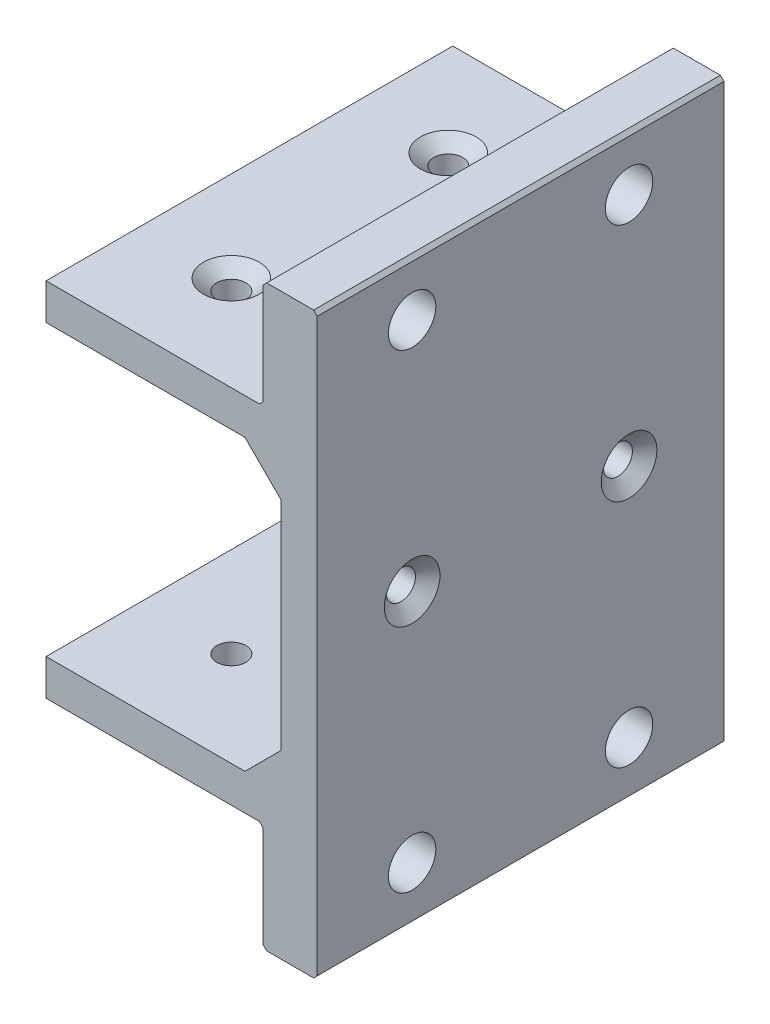
ISO-10303-21;
HEADER;
FILE_DESCRIPTION(('STEP AP214'),'2;1');
FILE_NAME('part.step','',(''),(''),'','','');
FILE_SCHEMA(('AUTOMOTIVE_DESIGN { 1 0 10303 214 1 1 1 1 }'));
ENDSEC;
DATA;
#1=APPLICATION_CONTEXT('core data for automotive mechanical design processes');
#2=APPLICATION_PROTOCOL_DEFINITION('international standard','automotive_design',2000,#1);
#3=PRODUCT_CONTEXT('',#1,'mechanical');
#4=PRODUCT('Part','Part','',(#3));
#5=PRODUCT_RELATED_PRODUCT_CATEGORY('part','',(#4));
#6=PRODUCT_DEFINITION_FORMATION('','',#4);
#7=PRODUCT_DEFINITION_CONTEXT('part definition',#1,'design');
#8=PRODUCT_DEFINITION('design','',#6,#7);
#9=PRODUCT_DEFINITION_SHAPE('','',#8);
#10=(LENGTH_UNIT() NAMED_UNIT(*) SI_UNIT(.MILLI.,.METRE.));
#11=(NAMED_UNIT(*) PLANE_ANGLE_UNIT() SI_UNIT($,.RADIAN.));
#12=(NAMED_UNIT(*) SI_UNIT($,.STERADIAN.) SOLID_ANGLE_UNIT());
#13=UNCERTAINTY_MEASURE_WITH_UNIT(LENGTH_MEASURE(1.E-05),#10,'distance_accuracy_value','');
#14=(GEOMETRIC_REPRESENTATION_CONTEXT(3) GLOBAL_UNCERTAINTY_ASSIGNED_CONTEXT((#13)) GLOBAL_UNIT_ASSIGNED_CONTEXT((#10,
#11,#12)) REPRESENTATION_CONTEXT('',''));
#15=CARTESIAN_POINT('',(0.,0.,0.));
#16=DIRECTION('',(0.,0.,1.));
#17=DIRECTION('',(1.,0.,0.));
#18=AXIS2_PLACEMENT_3D('',#15,#16,#17);
#19=CARTESIAN_POINT('',(-15.875,-25.4,35.7124));
#20=DIRECTION('',(0.,1.,0.));
#21=DIRECTION('',(1.,0.,0.));
#22=AXIS2_PLACEMENT_3D('',#19,#20,#21);
#23=PLANE('',#22);
#24=DIRECTION('',(-1.,0.,0.));
#25=VECTOR('',#24,1.);
#26=CARTESIAN_POINT('',(19.05,-25.4,-35.7124));
#27=LINE('',#26,#25);
#28=CARTESIAN_POINT('',(19.05,-25.4,-35.7124));
#29=VERTEX_POINT('',#28);
#30=CARTESIAN_POINT('',(-15.875,-25.4,-35.7124));
#31=VERTEX_POINT('',#30);
#32=EDGE_CURVE('E155',#29,#31,#27,.T.);
#33=ORIENTED_EDGE('',*,*,#32,.T.);
#34=DIRECTION('',(0.,0.,1.));
#35=VECTOR('',#34,1.);
#36=CARTESIAN_POINT('',(-15.875,-25.4,-35.7124));
#37=LINE('',#36,#35);
#38=CARTESIAN_POINT('',(-15.875,-25.4,35.7124));
#39=VERTEX_POINT('',#38);
#40=EDGE_CURVE('E170',#39,#31,#37,.F.);
#41=ORIENTED_EDGE('',*,*,#40,.F.);
#42=DIRECTION('',(1.,0.,0.));
#43=VECTOR('',#42,1.);
#44=CARTESIAN_POINT('',(-15.875,-25.4,35.7124));
#45=LINE('',#44,#43);
#46=CARTESIAN_POINT('',(19.05,-25.4,35.7124));
#47=VERTEX_POINT('',#46);
#48=EDGE_CURVE('E177',#47,#39,#45,.F.);
#49=ORIENTED_EDGE('',*,*,#48,.F.);
#50=DIRECTION('',(0.,0.,-1.));
#51=VECTOR('',#50,1.);
#52=CARTESIAN_POINT('',(19.05,-25.4,35.7124));
#53=LINE('',#52,#51);
#54=EDGE_CURVE('E172',#47,#29,#53,.T.);
#55=ORIENTED_EDGE('',*,*,#54,.T.);
#56=EDGE_LOOP('',(#33,#41,#49,#55));
#57=FACE_BOUND('',#56,.T.);
#58=CARTESIAN_POINT('',(0.,-25.4,19.05));
#59=DIRECTION('',(0.,-1.,0.));
#60=DIRECTION('',(0.,0.,1.));
#61=AXIS2_PLACEMENT_3D('',#58,#59,#60);
#62=CIRCLE('',#61,2.5527);
#63=CARTESIAN_POINT('',(0.,-25.4,21.6027));
#64=VERTEX_POINT('',#63);
#65=EDGE_CURVE('E188',#64,#64,#62,.F.);
#66=ORIENTED_EDGE('',*,*,#65,.F.);
#67=EDGE_LOOP('',(#66));
#68=FACE_BOUND('',#67,.T.);
#69=CARTESIAN_POINT('',(0.,-25.4,-19.05));
#70=DIRECTION('',(0.,-1.,0.));
#71=DIRECTION('',(0.,0.,1.));
#72=AXIS2_PLACEMENT_3D('',#69,#70,#71);
#73=CIRCLE('',#72,2.5527);
#74=CARTESIAN_POINT('',(0.,-25.4,-16.4973));
#75=VERTEX_POINT('',#74);
#76=EDGE_CURVE('E163',#75,#75,#73,.F.);
#77=ORIENTED_EDGE('',*,*,#76,.F.);
#78=EDGE_LOOP('',(#77));
#79=FACE_BOUND('',#78,.T.);
#80=ADVANCED_FACE('F17',(#57,#68,#79),#23,.T.);
#81=CARTESIAN_POINT('',(-15.875,-31.75,35.7124));
#82=DIRECTION('',(-1.,0.,0.));
#83=DIRECTION('',(0.,1.,0.));
#84=AXIS2_PLACEMENT_3D('',#81,#82,#83);
#85=PLANE('',#84);
#86=DIRECTION('',(0.,-1.,0.));
#87=VECTOR('',#86,1.);
#88=CARTESIAN_POINT('',(-15.875,-25.4,-35.7124));
#89=LINE('',#88,#87);
#90=CARTESIAN_POINT('',(-15.875,-31.75,-35.7124));
#91=VERTEX_POINT('',#90);
#92=EDGE_CURVE('E152',#31,#91,#89,.T.);
#93=ORIENTED_EDGE('',*,*,#92,.T.);
#94=DIRECTION('',(0.,0.,1.));
#95=VECTOR('',#94,1.);
#96=CARTESIAN_POINT('',(-15.875,-31.75,-35.7124));
#97=LINE('',#96,#95);
#98=CARTESIAN_POINT('',(-15.875,-31.75,35.7124));
#99=VERTEX_POINT('',#98);
#100=EDGE_CURVE('E162',#99,#91,#97,.F.);
#101=ORIENTED_EDGE('',*,*,#100,.F.);
#102=DIRECTION('',(0.,1.,0.));
#103=VECTOR('',#102,1.);
#104=CARTESIAN_POINT('',(-15.875,-31.75,35.7124));
#105=LINE('',#104,#103);
#106=EDGE_CURVE('E176',#39,#99,#105,.F.);
#107=ORIENTED_EDGE('',*,*,#106,.F.);
#108=ORIENTED_EDGE('',*,*,#40,.T.);
#109=EDGE_LOOP('',(#93,#101,#107,#108));
#110=FACE_BOUND('',#109,.T.);
#111=ADVANCED_FACE('F175',(#110),#85,.T.);
#112=CARTESIAN_POINT('',(-15.875,-31.75,-35.7124));
#113=DIRECTION('',(0.,-1.,0.));
#114=DIRECTION('',(1.,0.,0.));
#115=AXIS2_PLACEMENT_3D('',#112,#113,#114);
#116=PLANE('',#115);
#117=DIRECTION('',(1.,0.,0.));
#118=VECTOR('',#117,1.);
#119=CARTESIAN_POINT('',(-15.875,-31.75,-35.7124));
#120=LINE('',#119,#118);
#121=CARTESIAN_POINT('',(21.59,-31.75,-35.7124));
#122=VERTEX_POINT('',#121);
#123=EDGE_CURVE('E157',#91,#122,#120,.T.);
#124=ORIENTED_EDGE('',*,*,#123,.T.);
#125=DIRECTION('',(0.,0.,1.));
#126=VECTOR('',#125,1.);
#127=CARTESIAN_POINT('',(21.59,-31.75,-35.7124));
#128=LINE('',#127,#126);
#129=CARTESIAN_POINT('',(21.59,-31.75,35.7124));
#130=VERTEX_POINT('',#129);
#131=EDGE_CURVE('E204',#130,#122,#128,.F.);
#132=ORIENTED_EDGE('',*,*,#131,.F.);
#133=DIRECTION('',(-1.,0.,0.));
#134=VECTOR('',#133,1.);
#135=CARTESIAN_POINT('',(21.59,-31.75,35.7124));
#136=LINE('',#135,#134);
#137=EDGE_CURVE('E209',#99,#130,#136,.F.);
#138=ORIENTED_EDGE('',*,*,#137,.F.);
#139=ORIENTED_EDGE('',*,*,#100,.T.);
#140=EDGE_LOOP('',(#124,#132,#138,#139));
#141=FACE_BOUND('',#140,.T.);
#142=CARTESIAN_POINT('',(0.,-31.75,19.05));
#143=DIRECTION('',(0.,1.,0.));
#144=DIRECTION('',(0.,0.,-1.));
#145=AXIS2_PLACEMENT_3D('',#142,#143,#144);
#146=CIRCLE('',#145,4.8895);
#147=CARTESIAN_POINT('',(0.,-31.75,14.1605));
#148=VERTEX_POINT('',#147);
#149=EDGE_CURVE('E213',#148,#148,#146,.T.);
#150=ORIENTED_EDGE('',*,*,#149,.T.);
#151=EDGE_LOOP('',(#150));
#152=FACE_BOUND('',#151,.T.);
#153=CARTESIAN_POINT('',(0.,-31.75,-19.05));
#154=DIRECTION('',(0.,1.,0.));
#155=DIRECTION('',(0.,0.,-1.));
#156=AXIS2_PLACEMENT_3D('',#153,#154,#155);
#157=CIRCLE('',#156,4.8895);
#158=CARTESIAN_POINT('',(0.,-31.75,-23.9395));
#159=VERTEX_POINT('',#158);
#160=EDGE_CURVE('E218',#159,#159,#157,.T.);
#161=ORIENTED_EDGE('',*,*,#160,.T.);
#162=EDGE_LOOP('',(#161));
#163=FACE_BOUND('',#162,.T.);
#164=ADVANCED_FACE('F533',(#141,#152,#163),#116,.T.);
#165=CARTESIAN_POINT('',(22.225,-32.385,-35.7124));
#166=DIRECTION('',(-0.707106781186546,-0.70710678118655,0.));
#167=DIRECTION('',(0.,0.,1.));
#168=AXIS2_PLACEMENT_3D('',#165,#166,#167);
#169=PLANE('',#168);
#170=DIRECTION('',(0.707106781186546,-0.70710678118655,0.));
#171=VECTOR('',#170,1.);
#172=CARTESIAN_POINT('',(21.59,-31.75,-35.7124));
#173=LINE('',#172,#171);
#174=CARTESIAN_POINT('',(22.225,-32.385,-35.7124));
#175=VERTEX_POINT('',#174);
#176=EDGE_CURVE('E221',#122,#175,#173,.T.);
#177=ORIENTED_EDGE('',*,*,#176,.T.);
#178=DIRECTION('',(0.,0.,1.));
#179=VECTOR('',#178,1.);
#180=CARTESIAN_POINT('',(22.225,-32.385,-35.7124));
#181=LINE('',#180,#179);
#182=CARTESIAN_POINT('',(22.225,-32.385,35.7124));
#183=VERTEX_POINT('',#182);
#184=EDGE_CURVE('E224',#183,#175,#181,.F.);
#185=ORIENTED_EDGE('',*,*,#184,.F.);
#186=DIRECTION('',(-0.707106781186548,0.707106781186548,0.));
#187=VECTOR('',#186,1.);
#188=CARTESIAN_POINT('',(22.225,-32.385,35.7124));
#189=LINE('',#188,#187);
#190=EDGE_CURVE('E229',#130,#183,#189,.F.);
#191=ORIENTED_EDGE('',*,*,#190,.F.);
#192=ORIENTED_EDGE('',*,*,#131,.T.);
#193=EDGE_LOOP('',(#177,#185,#191,#192));
#194=FACE_BOUND('',#193,.T.);
#195=ADVANCED_FACE('F538',(#194),#169,.T.);
#196=CARTESIAN_POINT('',(22.225,-50.165,35.7124));
#197=DIRECTION('',(-1.,0.,0.));
#198=DIRECTION('',(0.,1.,0.));
#199=AXIS2_PLACEMENT_3D('',#196,#197,#198);
#200=PLANE('',#199);
#201=DIRECTION('',(0.,-1.,0.));
#202=VECTOR('',#201,1.);
#203=CARTESIAN_POINT('',(22.225,-32.385,-35.7124));
#204=LINE('',#203,#202);
#205=CARTESIAN_POINT('',(22.225,-50.165,-35.7124));
#206=VERTEX_POINT('',#205);
#207=EDGE_CURVE('E233',#175,#206,#204,.T.);
#208=ORIENTED_EDGE('',*,*,#207,.T.);
#209=DIRECTION('',(0.,0.,1.));
#210=VECTOR('',#209,1.);
#211=CARTESIAN_POINT('',(22.225,-50.165,-35.7124));
#212=LINE('',#211,#210);
#213=CARTESIAN_POINT('',(22.225,-50.165,35.7124));
#214=VERTEX_POINT('',#213);
#215=EDGE_CURVE('E238',#214,#206,#212,.F.);
#216=ORIENTED_EDGE('',*,*,#215,.F.);
#217=DIRECTION('',(0.,1.,0.));
#218=VECTOR('',#217,1.);
#219=CARTESIAN_POINT('',(22.225,-50.165,35.7124));
#220=LINE('',#219,#218);
#221=EDGE_CURVE('E243',#183,#214,#220,.F.);
#222=ORIENTED_EDGE('',*,*,#221,.F.);
#223=ORIENTED_EDGE('',*,*,#184,.T.);
#224=EDGE_LOOP('',(#208,#216,#222,#223));
#225=FACE_BOUND('',#224,.T.);
#226=CARTESIAN_POINT('',(22.225,-41.275,-19.05));
#227=DIRECTION('',(1.,0.,0.));
#228=DIRECTION('',(0.,-1.42053837271799E-07,0.99999999999999));
#229=AXIS2_PLACEMENT_3D('',#226,#227,#228);
#230=CIRCLE('',#229,4.1656);
#231=CARTESIAN_POINT('',(22.225,-41.2750005917395,-14.8844));
#232=VERTEX_POINT('',#231);
#233=EDGE_CURVE('E247',#232,#232,#230,.T.);
#234=ORIENTED_EDGE('',*,*,#233,.T.);
#235=EDGE_LOOP('',(#234));
#236=FACE_BOUND('',#235,.T.);
#237=CARTESIAN_POINT('',(22.225,-41.275,19.05));
#238=DIRECTION('',(1.,0.,0.));
#239=DIRECTION('',(0.,-1.42053931087456E-07,0.99999999999999));
#240=AXIS2_PLACEMENT_3D('',#237,#238,#239);
#241=CIRCLE('',#240,4.1656);
#242=CARTESIAN_POINT('',(22.225,-41.2750005917399,23.2156));
#243=VERTEX_POINT('',#242);
#244=EDGE_CURVE('E252',#243,#243,#241,.T.);
#245=ORIENTED_EDGE('',*,*,#244,.T.);
#246=EDGE_LOOP('',(#245));
#247=FACE_BOUND('',#246,.T.);
#248=ADVANCED_FACE('F542',(#225,#236,#247),#200,.T.);
#249=CARTESIAN_POINT('',(22.86,-50.8,-35.7124));
#250=DIRECTION('',(-0.707106781186546,-0.70710678118655,0.));
#251=DIRECTION('',(0.,0.,1.));
#252=AXIS2_PLACEMENT_3D('',#249,#250,#251);
#253=PLANE('',#252);
#254=DIRECTION('',(0.707106781186552,-0.707106781186544,0.));
#255=VECTOR('',#254,1.);
#256=CARTESIAN_POINT('',(22.225,-50.165,-35.7124));
#257=LINE('',#256,#255);
#258=CARTESIAN_POINT('',(22.86,-50.8,-35.7124));
#259=VERTEX_POINT('',#258);
#260=EDGE_CURVE('E255',#206,#259,#257,.T.);
#261=ORIENTED_EDGE('',*,*,#260,.T.);
#262=DIRECTION('',(0.,0.,1.));
#263=VECTOR('',#262,1.);
#264=CARTESIAN_POINT('',(22.86,-50.8,-35.7124));
#265=LINE('',#264,#263);
#266=CARTESIAN_POINT('',(22.86,-50.8,35.7124));
#267=VERTEX_POINT('',#266);
#268=EDGE_CURVE('E258',#267,#259,#265,.F.);
#269=ORIENTED_EDGE('',*,*,#268,.F.);
#270=DIRECTION('',(-0.707106781186548,0.707106781186548,0.));
#271=VECTOR('',#270,1.);
#272=CARTESIAN_POINT('',(22.86,-50.8,35.7124));
#273=LINE('',#272,#271);
#274=EDGE_CURVE('E263',#214,#267,#273,.F.);
#275=ORIENTED_EDGE('',*,*,#274,.F.);
#276=ORIENTED_EDGE('',*,*,#215,.T.);
#277=EDGE_LOOP('',(#261,#269,#275,#276));
#278=FACE_BOUND('',#277,.T.);
#279=ADVANCED_FACE('F546',(#278),#253,.T.);
#280=CARTESIAN_POINT('',(22.86,-50.8,-35.7124));
#281=DIRECTION('',(0.,-1.,0.));
#282=DIRECTION('',(1.,0.,0.));
#283=AXIS2_PLACEMENT_3D('',#280,#281,#282);
#284=PLANE('',#283);
#285=DIRECTION('',(1.,0.,0.));
#286=VECTOR('',#285,1.);
#287=CARTESIAN_POINT('',(22.86,-50.8,-35.7124));
#288=LINE('',#287,#286);
#289=CARTESIAN_POINT('',(31.115,-50.8,-35.7124));
#290=VERTEX_POINT('',#289);
#291=EDGE_CURVE('E267',#259,#290,#288,.T.);
#292=ORIENTED_EDGE('',*,*,#291,.T.);
#293=DIRECTION('',(0.,0.,1.));
#294=VECTOR('',#293,1.);
#295=CARTESIAN_POINT('',(31.115,-50.8,-35.7124));
#296=LINE('',#295,#294);
#297=CARTESIAN_POINT('',(31.115,-50.8,35.7124));
#298=VERTEX_POINT('',#297);
#299=EDGE_CURVE('E272',#298,#290,#296,.F.);
#300=ORIENTED_EDGE('',*,*,#299,.F.);
#301=DIRECTION('',(-1.,0.,0.));
#302=VECTOR('',#301,1.);
#303=CARTESIAN_POINT('',(31.115,-50.8,35.7124));
#304=LINE('',#303,#302);
#305=EDGE_CURVE('E277',#267,#298,#304,.F.);
#306=ORIENTED_EDGE('',*,*,#305,.F.);
#307=ORIENTED_EDGE('',*,*,#268,.T.);
#308=EDGE_LOOP('',(#292,#300,#306,#307));
#309=FACE_BOUND('',#308,.T.);
#310=ADVANCED_FACE('F550',(#309),#284,.T.);
#311=CARTESIAN_POINT('',(31.75,-50.165,-35.7124));
#312=DIRECTION('',(0.707106781186546,-0.70710678118655,0.));
#313=DIRECTION('',(0.,0.,1.));
#314=AXIS2_PLACEMENT_3D('',#311,#312,#313);
#315=PLANE('',#314);
#316=DIRECTION('',(0.70710678118655,0.707106781186546,0.));
#317=VECTOR('',#316,1.);
#318=CARTESIAN_POINT('',(31.115,-50.8,-35.7124));
#319=LINE('',#318,#317);
#320=CARTESIAN_POINT('',(31.75,-50.165,-35.7124));
#321=VERTEX_POINT('',#320);
#322=EDGE_CURVE('E281',#290,#321,#319,.T.);
#323=ORIENTED_EDGE('',*,*,#322,.T.);
#324=DIRECTION('',(0.,0.,1.));
#325=VECTOR('',#324,1.);
#326=CARTESIAN_POINT('',(31.75,-50.165,-35.7124));
#327=LINE('',#326,#325);
#328=CARTESIAN_POINT('',(31.75,-50.165,35.7124));
#329=VERTEX_POINT('',#328);
#330=EDGE_CURVE('E286',#329,#321,#327,.F.);
#331=ORIENTED_EDGE('',*,*,#330,.F.);
#332=DIRECTION('',(-0.707106781186549,-0.707106781186546,0.));
#333=VECTOR('',#332,1.);
#334=CARTESIAN_POINT('',(31.75,-50.165,35.7124));
#335=LINE('',#334,#333);
#336=EDGE_CURVE('E291',#298,#329,#335,.F.);
#337=ORIENTED_EDGE('',*,*,#336,.F.);
#338=ORIENTED_EDGE('',*,*,#299,.T.);
#339=EDGE_LOOP('',(#323,#331,#337,#338));
#340=FACE_BOUND('',#339,.T.);
#341=ADVANCED_FACE('F554',(#340),#315,.T.);
#342=CARTESIAN_POINT('',(31.75,-50.165,-35.7124));
#343=DIRECTION('',(1.,0.,0.));
#344=DIRECTION('',(0.,1.,0.));
#345=AXIS2_PLACEMENT_3D('',#342,#343,#344);
#346=PLANE('',#345);
#347=DIRECTION('',(0.,1.,0.));
#348=VECTOR('',#347,1.);
#349=CARTESIAN_POINT('',(31.75,-50.165,-35.7124));
#350=LINE('',#349,#348);
#351=CARTESIAN_POINT('',(31.75,50.165,-35.7124));
#352=VERTEX_POINT('',#351);
#353=EDGE_CURVE('E295',#321,#352,#350,.T.);
#354=ORIENTED_EDGE('',*,*,#353,.T.);
#355=DIRECTION('',(0.,0.,1.));
#356=VECTOR('',#355,1.);
#357=CARTESIAN_POINT('',(31.75,50.165,-35.7124));
#358=LINE('',#357,#356);
#359=CARTESIAN_POINT('',(31.75,50.165,35.7124));
#360=VERTEX_POINT('',#359);
#361=EDGE_CURVE('E300',#360,#352,#358,.F.);
#362=ORIENTED_EDGE('',*,*,#361,.F.);
#363=DIRECTION('',(0.,-1.,0.));
#364=VECTOR('',#363,1.);
#365=CARTESIAN_POINT('',(31.75,50.165,35.7124));
#366=LINE('',#365,#364);
#367=EDGE_CURVE('E305',#329,#360,#366,.F.);
#368=ORIENTED_EDGE('',*,*,#367,.F.);
#369=ORIENTED_EDGE('',*,*,#330,.T.);
#370=EDGE_LOOP('',(#354,#362,#368,#369));
#371=FACE_BOUND('',#370,.T.);
#372=CARTESIAN_POINT('',(31.75,0.,19.05));
#373=DIRECTION('',(-1.,0.,0.));
#374=DIRECTION('',(0.,0.,-1.));
#375=AXIS2_PLACEMENT_3D('',#372,#373,#374);
#376=CIRCLE('',#375,4.88949999999997);
#377=CARTESIAN_POINT('',(31.75,0.,14.1605));
#378=VERTEX_POINT('',#377);
#379=EDGE_CURVE('E309',#378,#378,#376,.F.);
#380=ORIENTED_EDGE('',*,*,#379,.F.);
#381=EDGE_LOOP('',(#380));
#382=FACE_BOUND('',#381,.T.);
#383=CARTESIAN_POINT('',(31.75,0.,-19.05));
#384=DIRECTION('',(-1.,0.,0.));
#385=DIRECTION('',(0.,0.,-1.));
#386=AXIS2_PLACEMENT_3D('',#383,#384,#385);
#387=CIRCLE('',#386,4.88949999999997);
#388=CARTESIAN_POINT('',(31.75,0.,-23.9395));
#389=VERTEX_POINT('',#388);
#390=EDGE_CURVE('E314',#389,#389,#387,.F.);
#391=ORIENTED_EDGE('',*,*,#390,.F.);
#392=EDGE_LOOP('',(#391));
#393=FACE_BOUND('',#392,.T.);
#394=CARTESIAN_POINT('',(31.75,-41.275,19.05));
#395=DIRECTION('',(-1.,0.,0.));
#396=DIRECTION('',(0.,0.,-1.));
#397=AXIS2_PLACEMENT_3D('',#394,#395,#396);
#398=CIRCLE('',#397,4.1656);
#399=CARTESIAN_POINT('',(31.75,-41.275,14.8844));
#400=VERTEX_POINT('',#399);
#401=EDGE_CURVE('E317',#400,#400,#398,.F.);
#402=ORIENTED_EDGE('',*,*,#401,.F.);
#403=EDGE_LOOP('',(#402));
#404=FACE_BOUND('',#403,.T.);
#405=CARTESIAN_POINT('',(31.75,-41.275,-19.05));
#406=DIRECTION('',(-1.,0.,0.));
#407=DIRECTION('',(0.,0.,-1.));
#408=AXIS2_PLACEMENT_3D('',#405,#406,#407);
#409=CIRCLE('',#408,4.1656);
#410=CARTESIAN_POINT('',(31.75,-41.275,-23.2156));
#411=VERTEX_POINT('',#410);
#412=EDGE_CURVE('E320',#411,#411,#409,.F.);
#413=ORIENTED_EDGE('',*,*,#412,.F.);
#414=EDGE_LOOP('',(#413));
#415=FACE_BOUND('',#414,.T.);
#416=CARTESIAN_POINT('',(31.75,41.275,19.05));
#417=DIRECTION('',(-1.,0.,0.));
#418=DIRECTION('',(0.,0.,-1.));
#419=AXIS2_PLACEMENT_3D('',#416,#417,#418);
#420=CIRCLE('',#419,4.1656);
#421=CARTESIAN_POINT('',(31.75,41.275,14.8844));
#422=VERTEX_POINT('',#421);
#423=EDGE_CURVE('E323',#422,#422,#420,.F.);
#424=ORIENTED_EDGE('',*,*,#423,.F.);
#425=EDGE_LOOP('',(#424));
#426=FACE_BOUND('',#425,.T.);
#427=CARTESIAN_POINT('',(31.75,41.275,-19.05));
#428=DIRECTION('',(-1.,0.,0.));
#429=DIRECTION('',(0.,0.,-1.));
#430=AXIS2_PLACEMENT_3D('',#427,#428,#429);
#431=CIRCLE('',#430,4.1656);
#432=CARTESIAN_POINT('',(31.75,41.275,-23.2156));
#433=VERTEX_POINT('',#432);
#434=EDGE_CURVE('E326',#433,#433,#431,.F.);
#435=ORIENTED_EDGE('',*,*,#434,.F.);
#436=EDGE_LOOP('',(#435));
#437=FACE_BOUND('',#436,.T.);
#438=ADVANCED_FACE('F558',(#371,#382,#393,#404,#415,#426,#437),#346,.T.);
#439=CARTESIAN_POINT('',(31.115,50.8,-35.7124));
#440=DIRECTION('',(0.707106781186546,0.70710678118655,0.));
#441=DIRECTION('',(0.,0.,1.));
#442=AXIS2_PLACEMENT_3D('',#439,#440,#441);
#443=PLANE('',#442);
#444=DIRECTION('',(-0.707106781186549,0.707106781186546,0.));
#445=VECTOR('',#444,1.);
#446=CARTESIAN_POINT('',(31.75,50.165,-35.7124));
#447=LINE('',#446,#445);
#448=CARTESIAN_POINT('',(31.115,50.8,-35.7124));
#449=VERTEX_POINT('',#448);
#450=EDGE_CURVE('E329',#352,#449,#447,.T.);
#451=ORIENTED_EDGE('',*,*,#450,.T.);
#452=DIRECTION('',(0.,0.,1.));
#453=VECTOR('',#452,1.);
#454=CARTESIAN_POINT('',(31.115,50.8,-35.7124));
#455=LINE('',#454,#453);
#456=CARTESIAN_POINT('',(31.115,50.8,35.7124));
#457=VERTEX_POINT('',#456);
#458=EDGE_CURVE('E332',#457,#449,#455,.F.);
#459=ORIENTED_EDGE('',*,*,#458,.F.);
#460=DIRECTION('',(0.707106781186546,-0.70710678118655,0.));
#461=VECTOR('',#460,1.);
#462=CARTESIAN_POINT('',(31.115,50.8,35.7124));
#463=LINE('',#462,#461);
#464=EDGE_CURVE('E337',#360,#457,#463,.F.);
#465=ORIENTED_EDGE('',*,*,#464,.F.);
#466=ORIENTED_EDGE('',*,*,#361,.T.);
#467=EDGE_LOOP('',(#451,#459,#465,#466));
#468=FACE_BOUND('',#467,.T.);
#469=ADVANCED_FACE('F562',(#468),#443,.T.);
#470=CARTESIAN_POINT('',(22.86,50.8,35.7124));
#471=DIRECTION('',(0.,1.,0.));
#472=DIRECTION('',(1.,0.,0.));
#473=AXIS2_PLACEMENT_3D('',#470,#471,#472);
#474=PLANE('',#473);
#475=DIRECTION('',(-1.,0.,0.));
#476=VECTOR('',#475,1.);
#477=CARTESIAN_POINT('',(31.115,50.8,-35.7124));
#478=LINE('',#477,#476);
#479=CARTESIAN_POINT('',(22.86,50.8,-35.7124));
#480=VERTEX_POINT('',#479);
#481=EDGE_CURVE('E341',#449,#480,#478,.T.);
#482=ORIENTED_EDGE('',*,*,#481,.T.);
#483=DIRECTION('',(0.,0.,1.));
#484=VECTOR('',#483,1.);
#485=CARTESIAN_POINT('',(22.86,50.8,-35.7124));
#486=LINE('',#485,#484);
#487=CARTESIAN_POINT('',(22.86,50.8,35.7124));
#488=VERTEX_POINT('',#487);
#489=EDGE_CURVE('E346',#488,#480,#486,.F.);
#490=ORIENTED_EDGE('',*,*,#489,.F.);
#491=DIRECTION('',(1.,0.,0.));
#492=VECTOR('',#491,1.);
#493=CARTESIAN_POINT('',(22.86,50.8,35.7124));
#494=LINE('',#493,#492);
#495=EDGE_CURVE('E351',#457,#488,#494,.F.);
#496=ORIENTED_EDGE('',*,*,#495,.F.);
#497=ORIENTED_EDGE('',*,*,#458,.T.);
#498=EDGE_LOOP('',(#482,#490,#496,#497));
#499=FACE_BOUND('',#498,.T.);
#500=ADVANCED_FACE('F566',(#499),#474,.T.);
#501=CARTESIAN_POINT('',(22.225,50.165,-35.7124));
#502=DIRECTION('',(-0.707106781186546,0.70710678118655,0.));
#503=DIRECTION('',(0.,0.,1.));
#504=AXIS2_PLACEMENT_3D('',#501,#502,#503);
#505=PLANE('',#504);
#506=DIRECTION('',(-0.707106781186552,-0.707106781186544,0.));
#507=VECTOR('',#506,1.);
#508=CARTESIAN_POINT('',(22.86,50.8,-35.7124));
#509=LINE('',#508,#507);
#510=CARTESIAN_POINT('',(22.225,50.165,-35.7124));
#511=VERTEX_POINT('',#510);
#512=EDGE_CURVE('E355',#480,#511,#509,.T.);
#513=ORIENTED_EDGE('',*,*,#512,.T.);
#514=DIRECTION('',(0.,0.,1.));
#515=VECTOR('',#514,1.);
#516=CARTESIAN_POINT('',(22.225,50.165,-35.7124));
#517=LINE('',#516,#515);
#518=CARTESIAN_POINT('',(22.225,50.165,35.7124));
#519=VERTEX_POINT('',#518);
#520=EDGE_CURVE('E360',#519,#511,#517,.F.);
#521=ORIENTED_EDGE('',*,*,#520,.F.);
#522=DIRECTION('',(0.70710678118655,0.707106781186546,0.));
#523=VECTOR('',#522,1.);
#524=CARTESIAN_POINT('',(22.225,50.165,35.7124));
#525=LINE('',#524,#523);
#526=EDGE_CURVE('E365',#488,#519,#525,.F.);
#527=ORIENTED_EDGE('',*,*,#526,.F.);
#528=ORIENTED_EDGE('',*,*,#489,.T.);
#529=EDGE_LOOP('',(#513,#521,#527,#528));
#530=FACE_BOUND('',#529,.T.);
#531=ADVANCED_FACE('F570',(#530),#505,.T.);
#532=CARTESIAN_POINT('',(22.225,32.385,35.7124));
#533=DIRECTION('',(-1.,0.,0.));
#534=DIRECTION('',(0.,1.,0.));
#535=AXIS2_PLACEMENT_3D('',#532,#533,#534);
#536=PLANE('',#535);
#537=DIRECTION('',(0.,-1.,0.));
#538=VECTOR('',#537,1.);
#539=CARTESIAN_POINT('',(22.225,50.165,-35.7124));
#540=LINE('',#539,#538);
#541=CARTESIAN_POINT('',(22.225,32.385,-35.7124));
#542=VERTEX_POINT('',#541);
#543=EDGE_CURVE('E369',#511,#542,#540,.T.);
#544=ORIENTED_EDGE('',*,*,#543,.T.);
#545=DIRECTION('',(0.,0.,1.));
#546=VECTOR('',#545,1.);
#547=CARTESIAN_POINT('',(22.225,32.385,-35.7124));
#548=LINE('',#547,#546);
#549=CARTESIAN_POINT('',(22.225,32.385,35.7124));
#550=VERTEX_POINT('',#549);
#551=EDGE_CURVE('E374',#550,#542,#548,.F.);
#552=ORIENTED_EDGE('',*,*,#551,.F.);
#553=DIRECTION('',(0.,1.,0.));
#554=VECTOR('',#553,1.);
#555=CARTESIAN_POINT('',(22.225,32.385,35.7124));
#556=LINE('',#555,#554);
#557=EDGE_CURVE('E379',#519,#550,#556,.F.);
#558=ORIENTED_EDGE('',*,*,#557,.F.);
#559=ORIENTED_EDGE('',*,*,#520,.T.);
#560=EDGE_LOOP('',(#544,#552,#558,#559));
#561=FACE_BOUND('',#560,.T.);
#562=CARTESIAN_POINT('',(22.225,41.275,19.05));
#563=DIRECTION('',(1.,0.,0.));
#564=DIRECTION('',(0.,-1.42053931087456E-07,0.99999999999999));
#565=AXIS2_PLACEMENT_3D('',#562,#563,#564);
#566=CIRCLE('',#565,4.1656);
#567=CARTESIAN_POINT('',(22.225,41.2749994082601,23.2156));
#568=VERTEX_POINT('',#567);
#569=EDGE_CURVE('E383',#568,#568,#566,.T.);
#570=ORIENTED_EDGE('',*,*,#569,.T.);
#571=EDGE_LOOP('',(#570));
#572=FACE_BOUND('',#571,.T.);
#573=CARTESIAN_POINT('',(22.225,41.275,-19.05));
#574=DIRECTION('',(1.,0.,0.));
#575=DIRECTION('',(0.,-1.42053837271799E-07,0.99999999999999));
#576=AXIS2_PLACEMENT_3D('',#573,#574,#575);
#577=CIRCLE('',#576,4.1656);
#578=CARTESIAN_POINT('',(22.225,41.2749994082605,-14.8844));
#579=VERTEX_POINT('',#578);
#580=EDGE_CURVE('E388',#579,#579,#577,.T.);
#581=ORIENTED_EDGE('',*,*,#580,.T.);
#582=EDGE_LOOP('',(#581));
#583=FACE_BOUND('',#582,.T.);
#584=ADVANCED_FACE('F574',(#561,#572,#583),#536,.T.);
#585=CARTESIAN_POINT('',(21.59,31.75,-35.7124));
#586=DIRECTION('',(-0.707106781186546,0.70710678118655,0.));
#587=DIRECTION('',(0.,0.,1.));
#588=AXIS2_PLACEMENT_3D('',#585,#586,#587);
#589=PLANE('',#588);
#590=DIRECTION('',(-0.70710678118655,-0.707106781186546,0.));
#591=VECTOR('',#590,1.);
#592=CARTESIAN_POINT('',(22.225,32.385,-35.7124));
#593=LINE('',#592,#591);
#594=CARTESIAN_POINT('',(21.59,31.75,-35.7124));
#595=VERTEX_POINT('',#594);
#596=EDGE_CURVE('E391',#542,#595,#593,.T.);
#597=ORIENTED_EDGE('',*,*,#596,.T.);
#598=DIRECTION('',(0.,0.,1.));
#599=VECTOR('',#598,1.);
#600=CARTESIAN_POINT('',(21.59,31.75,-35.7124));
#601=LINE('',#600,#599);
#602=CARTESIAN_POINT('',(21.59,31.75,35.7124));
#603=VERTEX_POINT('',#602);
#604=EDGE_CURVE('E394',#603,#595,#601,.F.);
#605=ORIENTED_EDGE('',*,*,#604,.F.);
#606=DIRECTION('',(0.70710678118655,0.707106781186546,0.));
#607=VECTOR('',#606,1.);
#608=CARTESIAN_POINT('',(21.59,31.75,35.7124));
#609=LINE('',#608,#607);
#610=EDGE_CURVE('E399',#550,#603,#609,.F.);
#611=ORIENTED_EDGE('',*,*,#610,.F.);
#612=ORIENTED_EDGE('',*,*,#551,.T.);
#613=EDGE_LOOP('',(#597,#605,#611,#612));
#614=FACE_BOUND('',#613,.T.);
#615=ADVANCED_FACE('F578',(#614),#589,.T.);
#616=CARTESIAN_POINT('',(-15.875,31.75,35.7124));
#617=DIRECTION('',(0.,1.,0.));
#618=DIRECTION('',(1.,0.,0.));
#619=AXIS2_PLACEMENT_3D('',#616,#617,#618);
#620=PLANE('',#619);
#621=DIRECTION('',(-1.,0.,0.));
#622=VECTOR('',#621,1.);
#623=CARTESIAN_POINT('',(21.59,31.75,-35.7124));
#624=LINE('',#623,#622);
#625=CARTESIAN_POINT('',(-15.875,31.75,-35.7124));
#626=VERTEX_POINT('',#625);
#627=EDGE_CURVE('E403',#595,#626,#624,.T.);
#628=ORIENTED_EDGE('',*,*,#627,.T.);
#629=DIRECTION('',(0.,0.,1.));
#630=VECTOR('',#629,1.);
#631=CARTESIAN_POINT('',(-15.875,31.75,-35.7124));
#632=LINE('',#631,#630);
#633=CARTESIAN_POINT('',(-15.875,31.75,35.7124));
#634=VERTEX_POINT('',#633);
#635=EDGE_CURVE('E408',#634,#626,#632,.F.);
#636=ORIENTED_EDGE('',*,*,#635,.F.);
#637=DIRECTION('',(1.,0.,0.));
#638=VECTOR('',#637,1.);
#639=CARTESIAN_POINT('',(-15.875,31.75,35.7124));
#640=LINE('',#639,#638);
#641=EDGE_CURVE('E413',#603,#634,#640,.F.);
#642=ORIENTED_EDGE('',*,*,#641,.F.);
#643=ORIENTED_EDGE('',*,*,#604,.T.);
#644=EDGE_LOOP('',(#628,#636,#642,#643));
#645=FACE_BOUND('',#644,.T.);
#646=CARTESIAN_POINT('',(0.,31.75,19.05));
#647=DIRECTION('',(0.,-1.,0.));
#648=DIRECTION('',(0.,0.,1.));
#649=AXIS2_PLACEMENT_3D('',#646,#647,#648);
#650=CIRCLE('',#649,4.88949999999997);
#651=CARTESIAN_POINT('',(0.,31.75,23.9395));
#652=VERTEX_POINT('',#651);
#653=EDGE_CURVE('E417',#652,#652,#650,.F.);
#654=ORIENTED_EDGE('',*,*,#653,.F.);
#655=EDGE_LOOP('',(#654));
#656=FACE_BOUND('',#655,.T.);
#657=CARTESIAN_POINT('',(0.,31.75,-19.05));
#658=DIRECTION('',(0.,-1.,0.));
#659=DIRECTION('',(0.,0.,1.));
#660=AXIS2_PLACEMENT_3D('',#657,#658,#659);
#661=CIRCLE('',#660,4.88949999999997);
#662=CARTESIAN_POINT('',(0.,31.75,-14.1605));
#663=VERTEX_POINT('',#662);
#664=EDGE_CURVE('E422',#663,#663,#661,.F.);
#665=ORIENTED_EDGE('',*,*,#664,.F.);
#666=EDGE_LOOP('',(#665));
#667=FACE_BOUND('',#666,.T.);
#668=ADVANCED_FACE('F582',(#645,#656,#667),#620,.T.);
#669=CARTESIAN_POINT('',(-15.875,25.4,35.7124));
#670=DIRECTION('',(-1.,0.,0.));
#671=DIRECTION('',(0.,1.,0.));
#672=AXIS2_PLACEMENT_3D('',#669,#670,#671);
#673=PLANE('',#672);
#674=DIRECTION('',(0.,-1.,0.));
#675=VECTOR('',#674,1.);
#676=CARTESIAN_POINT('',(-15.875,31.75,-35.7124));
#677=LINE('',#676,#675);
#678=CARTESIAN_POINT('',(-15.875,25.4,-35.7124));
#679=VERTEX_POINT('',#678);
#680=EDGE_CURVE('E425',#626,#679,#677,.T.);
#681=ORIENTED_EDGE('',*,*,#680,.T.);
#682=DIRECTION('',(0.,0.,1.));
#683=VECTOR('',#682,1.);
#684=CARTESIAN_POINT('',(-15.875,25.4,-35.7124));
#685=LINE('',#684,#683);
#686=CARTESIAN_POINT('',(-15.875,25.4,35.7124));
#687=VERTEX_POINT('',#686);
#688=EDGE_CURVE('E428',#687,#679,#685,.F.);
#689=ORIENTED_EDGE('',*,*,#688,.F.);
#690=DIRECTION('',(0.,1.,0.));
#691=VECTOR('',#690,1.);
#692=CARTESIAN_POINT('',(-15.875,25.4,35.7124));
#693=LINE('',#692,#691);
#694=EDGE_CURVE('E433',#634,#687,#693,.F.);
#695=ORIENTED_EDGE('',*,*,#694,.F.);
#696=ORIENTED_EDGE('',*,*,#635,.T.);
#697=EDGE_LOOP('',(#681,#689,#695,#696));
#698=FACE_BOUND('',#697,.T.);
#699=ADVANCED_FACE('F586',(#698),#673,.T.);
#700=CARTESIAN_POINT('',(-15.875,25.4,-35.7124));
#701=DIRECTION('',(0.,-1.,0.));
#702=DIRECTION('',(1.,0.,0.));
#703=AXIS2_PLACEMENT_3D('',#700,#701,#702);
#704=PLANE('',#703);
#705=DIRECTION('',(1.,0.,0.));
#706=VECTOR('',#705,1.);
#707=CARTESIAN_POINT('',(-15.875,25.4,-35.7124));
#708=LINE('',#707,#706);
#709=CARTESIAN_POINT('',(19.05,25.4,-35.7124));
#710=VERTEX_POINT('',#709);
#711=EDGE_CURVE('E437',#679,#710,#708,.T.);
#712=ORIENTED_EDGE('',*,*,#711,.T.);
#713=DIRECTION('',(0.,0.,1.));
#714=VECTOR('',#713,1.);
#715=CARTESIAN_POINT('',(19.05,25.4,-35.7124));
#716=LINE('',#715,#714);
#717=CARTESIAN_POINT('',(19.05,25.4,35.7124));
#718=VERTEX_POINT('',#717);
#719=EDGE_CURVE('E442',#718,#710,#716,.F.);
#720=ORIENTED_EDGE('',*,*,#719,.F.);
#721=DIRECTION('',(-1.,0.,0.));
#722=VECTOR('',#721,1.);
#723=CARTESIAN_POINT('',(19.05,25.4,35.7124));
#724=LINE('',#723,#722);
#725=EDGE_CURVE('E447',#687,#718,#724,.F.);
#726=ORIENTED_EDGE('',*,*,#725,.F.);
#727=ORIENTED_EDGE('',*,*,#688,.T.);
#728=EDGE_LOOP('',(#712,#720,#726,#727));
#729=FACE_BOUND('',#728,.T.);
#730=CARTESIAN_POINT('',(0.,25.4,19.05));
#731=DIRECTION('',(0.,1.,0.));
#732=DIRECTION('',(0.,0.,-1.));
#733=AXIS2_PLACEMENT_3D('',#730,#731,#732);
#734=CIRCLE('',#733,2.5527);
#735=CARTESIAN_POINT('',(0.,25.4,16.4973));
#736=VERTEX_POINT('',#735);
#737=EDGE_CURVE('E451',#736,#736,#734,.T.);
#738=ORIENTED_EDGE('',*,*,#737,.T.);
#739=EDGE_LOOP('',(#738));
#740=FACE_BOUND('',#739,.T.);
#741=CARTESIAN_POINT('',(0.,25.4,-19.05));
#742=DIRECTION('',(0.,1.,0.));
#743=DIRECTION('',(-1.42053767277086E-07,0.,-0.99999999999999));
#744=AXIS2_PLACEMENT_3D('',#741,#742,#743);
#745=CIRCLE('',#744,2.5527);
#746=CARTESIAN_POINT('',(-3.62620651728217E-07,25.4,-21.6027));
#747=VERTEX_POINT('',#746);
#748=EDGE_CURVE('E456',#747,#747,#745,.T.);
#749=ORIENTED_EDGE('',*,*,#748,.T.);
#750=EDGE_LOOP('',(#749));
#751=FACE_BOUND('',#750,.T.);
#752=ADVANCED_FACE('F590',(#729,#740,#751),#704,.T.);
#753=CARTESIAN_POINT('',(25.4,19.05,-35.7124));
#754=DIRECTION('',(-0.707106781186548,-0.707106781186548,0.));
#755=DIRECTION('',(0.,0.,1.));
#756=AXIS2_PLACEMENT_3D('',#753,#754,#755);
#757=PLANE('',#756);
#758=DIRECTION('',(0.707106781186548,-0.707106781186548,0.));
#759=VECTOR('',#758,1.);
#760=CARTESIAN_POINT('',(19.05,25.4,-35.7124));
#761=LINE('',#760,#759);
#762=CARTESIAN_POINT('',(25.4,19.05,-35.7124));
#763=VERTEX_POINT('',#762);
#764=EDGE_CURVE('E459',#710,#763,#761,.T.);
#765=ORIENTED_EDGE('',*,*,#764,.T.);
#766=DIRECTION('',(0.,0.,1.));
#767=VECTOR('',#766,1.);
#768=CARTESIAN_POINT('',(25.4,19.05,-35.7124));
#769=LINE('',#768,#767);
#770=CARTESIAN_POINT('',(25.4,19.05,35.7124));
#771=VERTEX_POINT('',#770);
#772=EDGE_CURVE('E462',#771,#763,#769,.F.);
#773=ORIENTED_EDGE('',*,*,#772,.F.);
#774=DIRECTION('',(-0.707106781186548,0.707106781186548,0.));
#775=VECTOR('',#774,1.);
#776=CARTESIAN_POINT('',(25.4,19.05,35.7124));
#777=LINE('',#776,#775);
#778=EDGE_CURVE('E467',#718,#771,#777,.F.);
#779=ORIENTED_EDGE('',*,*,#778,.F.);
#780=ORIENTED_EDGE('',*,*,#719,.T.);
#781=EDGE_LOOP('',(#765,#773,#779,#780));
#782=FACE_BOUND('',#781,.T.);
#783=ADVANCED_FACE('F594',(#782),#757,.T.);
#784=CARTESIAN_POINT('',(25.4,-19.05,35.7124));
#785=DIRECTION('',(-1.,0.,0.));
#786=DIRECTION('',(0.,1.,0.));
#787=AXIS2_PLACEMENT_3D('',#784,#785,#786);
#788=PLANE('',#787);
#789=DIRECTION('',(0.,-1.,0.));
#790=VECTOR('',#789,1.);
#791=CARTESIAN_POINT('',(25.4,19.05,-35.7124));
#792=LINE('',#791,#790);
#793=CARTESIAN_POINT('',(25.4,-19.05,-35.7124));
#794=VERTEX_POINT('',#793);
#795=EDGE_CURVE('E471',#763,#794,#792,.T.);
#796=ORIENTED_EDGE('',*,*,#795,.T.);
#797=DIRECTION('',(0.,0.,1.));
#798=VECTOR('',#797,1.);
#799=CARTESIAN_POINT('',(25.4,-19.05,-35.7124));
#800=LINE('',#799,#798);
#801=CARTESIAN_POINT('',(25.4,-19.05,35.7124));
#802=VERTEX_POINT('',#801);
#803=EDGE_CURVE('E475',#802,#794,#800,.F.);
#804=ORIENTED_EDGE('',*,*,#803,.F.);
#805=DIRECTION('',(0.,1.,0.));
#806=VECTOR('',#805,1.);
#807=CARTESIAN_POINT('',(25.4,-19.05,35.7124));
#808=LINE('',#807,#806);
#809=EDGE_CURVE('E32',#771,#802,#808,.F.);
#810=ORIENTED_EDGE('',*,*,#809,.F.);
#811=ORIENTED_EDGE('',*,*,#772,.T.);
#812=EDGE_LOOP('',(#796,#804,#810,#811));
#813=FACE_BOUND('',#812,.T.);
#814=CARTESIAN_POINT('',(25.4,0.,19.05));
#815=DIRECTION('',(1.,0.,0.));
#816=DIRECTION('',(0.,0.,1.));
#817=AXIS2_PLACEMENT_3D('',#814,#815,#816);
#818=CIRCLE('',#817,2.5527);
#819=CARTESIAN_POINT('',(25.4,0.,21.6027));
#820=VERTEX_POINT('',#819);
#821=EDGE_CURVE('E483',#820,#820,#818,.T.);
#822=ORIENTED_EDGE('',*,*,#821,.T.);
#823=EDGE_LOOP('',(#822));
#824=FACE_BOUND('',#823,.T.);
#825=CARTESIAN_POINT('',(25.4,0.,-19.05));
#826=DIRECTION('',(1.,0.,0.));
#827=DIRECTION('',(0.,0.,1.));
#828=AXIS2_PLACEMENT_3D('',#825,#826,#827);
#829=CIRCLE('',#828,2.5527);
#830=CARTESIAN_POINT('',(25.4,0.,-16.4973));
#831=VERTEX_POINT('',#830);
#832=EDGE_CURVE('E488',#831,#831,#829,.T.);
#833=ORIENTED_EDGE('',*,*,#832,.T.);
#834=EDGE_LOOP('',(#833));
#835=FACE_BOUND('',#834,.T.);
#836=ADVANCED_FACE('F598',(#813,#824,#835),#788,.T.);
#837=CARTESIAN_POINT('',(19.05,-25.4,-35.7124));
#838=DIRECTION('',(-0.707106781186548,0.707106781186548,0.));
#839=DIRECTION('',(0.,0.,1.));
#840=AXIS2_PLACEMENT_3D('',#837,#838,#839);
#841=PLANE('',#840);
#842=DIRECTION('',(-0.707106781186548,-0.707106781186548,0.));
#843=VECTOR('',#842,1.);
#844=CARTESIAN_POINT('',(25.4,-19.05,-35.7124));
#845=LINE('',#844,#843);
#846=EDGE_CURVE('E40',#794,#29,#845,.T.);
#847=ORIENTED_EDGE('',*,*,#846,.T.);
#848=ORIENTED_EDGE('',*,*,#54,.F.);
#849=DIRECTION('',(0.707106781186548,0.707106781186548,0.));
#850=VECTOR('',#849,1.);
#851=CARTESIAN_POINT('',(19.05,-25.4,35.7124));
#852=LINE('',#851,#850);
#853=EDGE_CURVE('E492',#802,#47,#852,.F.);
#854=ORIENTED_EDGE('',*,*,#853,.F.);
#855=ORIENTED_EDGE('',*,*,#803,.T.);
#856=EDGE_LOOP('',(#847,#848,#854,#855));
#857=FACE_BOUND('',#856,.T.);
#858=ADVANCED_FACE('F602',(#857),#841,.T.);
#859=CARTESIAN_POINT('',(-15.875,-50.8,35.7124));
#860=DIRECTION('',(0.,0.,1.));
#861=DIRECTION('',(1.,0.,0.));
#862=AXIS2_PLACEMENT_3D('',#859,#860,#861);
#863=PLANE('',#862);
#864=ORIENTED_EDGE('',*,*,#48,.T.);
#865=ORIENTED_EDGE('',*,*,#106,.T.);
#866=ORIENTED_EDGE('',*,*,#137,.T.);
#867=ORIENTED_EDGE('',*,*,#190,.T.);
#868=ORIENTED_EDGE('',*,*,#221,.T.);
#869=ORIENTED_EDGE('',*,*,#274,.T.);
#870=ORIENTED_EDGE('',*,*,#305,.T.);
#871=ORIENTED_EDGE('',*,*,#336,.T.);
#872=ORIENTED_EDGE('',*,*,#367,.T.);
#873=ORIENTED_EDGE('',*,*,#464,.T.);
#874=ORIENTED_EDGE('',*,*,#495,.T.);
#875=ORIENTED_EDGE('',*,*,#526,.T.);
#876=ORIENTED_EDGE('',*,*,#557,.T.);
#877=ORIENTED_EDGE('',*,*,#610,.T.);
#878=ORIENTED_EDGE('',*,*,#641,.T.);
#879=ORIENTED_EDGE('',*,*,#694,.T.);
#880=ORIENTED_EDGE('',*,*,#725,.T.);
#881=ORIENTED_EDGE('',*,*,#778,.T.);
#882=ORIENTED_EDGE('',*,*,#809,.T.);
#883=ORIENTED_EDGE('',*,*,#853,.T.);
#884=EDGE_LOOP('',(#864,#865,#866,#867,#868,#869,#870,#871,#872,#873,#874,#875,#876,#877,#878,
#879,#880,#881,#882,#883));
#885=FACE_BOUND('',#884,.T.);
#886=ADVANCED_FACE('F606',(#885),#863,.T.);
#887=CARTESIAN_POINT('',(-15.875,-50.8,-35.7124));
#888=DIRECTION('',(0.,0.,-1.));
#889=DIRECTION('',(0.,1.,0.));
#890=AXIS2_PLACEMENT_3D('',#887,#888,#889);
#891=PLANE('',#890);
#892=ORIENTED_EDGE('',*,*,#32,.F.);
#893=ORIENTED_EDGE('',*,*,#846,.F.);
#894=ORIENTED_EDGE('',*,*,#795,.F.);
#895=ORIENTED_EDGE('',*,*,#764,.F.);
#896=ORIENTED_EDGE('',*,*,#711,.F.);
#897=ORIENTED_EDGE('',*,*,#680,.F.);
#898=ORIENTED_EDGE('',*,*,#627,.F.);
#899=ORIENTED_EDGE('',*,*,#596,.F.);
#900=ORIENTED_EDGE('',*,*,#543,.F.);
#901=ORIENTED_EDGE('',*,*,#512,.F.);
#902=ORIENTED_EDGE('',*,*,#481,.F.);
#903=ORIENTED_EDGE('',*,*,#450,.F.);
#904=ORIENTED_EDGE('',*,*,#353,.F.);
#905=ORIENTED_EDGE('',*,*,#322,.F.);
#906=ORIENTED_EDGE('',*,*,#291,.F.);
#907=ORIENTED_EDGE('',*,*,#260,.F.);
#908=ORIENTED_EDGE('',*,*,#207,.F.);
#909=ORIENTED_EDGE('',*,*,#176,.F.);
#910=ORIENTED_EDGE('',*,*,#123,.F.);
#911=ORIENTED_EDGE('',*,*,#92,.F.);
#912=EDGE_LOOP('',(#892,#893,#894,#895,#896,#897,#898,#899,#900,#901,#902,#903,#904,#905,#906,
#907,#908,#909,#910,#911));
#913=FACE_BOUND('',#912,.T.);
#914=ADVANCED_FACE('F154',(#913),#891,.T.);
#915=CARTESIAN_POINT('',(31.75,41.275,19.05));
#916=DIRECTION('',(1.,0.,0.));
#917=DIRECTION('',(0.,1.42053842589258E-07,0.99999999999999));
#918=AXIS2_PLACEMENT_3D('',#915,#916,#917);
#919=CYLINDRICAL_SURFACE('',#918,4.1656);
#920=ORIENTED_EDGE('',*,*,#423,.T.);
#921=EDGE_LOOP('',(#920));
#922=FACE_BOUND('',#921,.T.);
#923=ORIENTED_EDGE('',*,*,#569,.F.);
#924=EDGE_LOOP('',(#923));
#925=FACE_BOUND('',#924,.T.);
#926=ADVANCED_FACE('F612',(#922,#925),#919,.F.);
#927=CARTESIAN_POINT('',(31.75,41.275,-19.05));
#928=DIRECTION('',(1.,0.,0.));
#929=DIRECTION('',(0.,1.42053846141972E-07,0.99999999999999));
#930=AXIS2_PLACEMENT_3D('',#927,#928,#929);
#931=CYLINDRICAL_SURFACE('',#930,4.1656);
#932=ORIENTED_EDGE('',*,*,#434,.T.);
#933=EDGE_LOOP('',(#932));
#934=FACE_BOUND('',#933,.T.);
#935=ORIENTED_EDGE('',*,*,#580,.F.);
#936=EDGE_LOOP('',(#935));
#937=FACE_BOUND('',#936,.T.);
#938=ADVANCED_FACE('F615',(#934,#937),#931,.F.);
#939=CARTESIAN_POINT('',(31.75,-41.275,-19.05));
#940=DIRECTION('',(1.,0.,0.));
#941=DIRECTION('',(0.,1.42053938068438E-07,0.99999999999999));
#942=AXIS2_PLACEMENT_3D('',#939,#940,#941);
#943=CYLINDRICAL_SURFACE('',#942,4.1656);
#944=ORIENTED_EDGE('',*,*,#412,.T.);
#945=EDGE_LOOP('',(#944));
#946=FACE_BOUND('',#945,.T.);
#947=ORIENTED_EDGE('',*,*,#233,.F.);
#948=EDGE_LOOP('',(#947));
#949=FACE_BOUND('',#948,.T.);
#950=ADVANCED_FACE('F619',(#946,#949),#943,.F.);
#951=CARTESIAN_POINT('',(31.75,-41.275,19.05));
#952=DIRECTION('',(1.,0.,0.));
#953=DIRECTION('',(0.,1.42053938068438E-07,0.99999999999999));
#954=AXIS2_PLACEMENT_3D('',#951,#952,#953);
#955=CYLINDRICAL_SURFACE('',#954,4.1656);
#956=ORIENTED_EDGE('',*,*,#401,.T.);
#957=EDGE_LOOP('',(#956));
#958=FACE_BOUND('',#957,.T.);
#959=ORIENTED_EDGE('',*,*,#244,.F.);
#960=EDGE_LOOP('',(#959));
#961=FACE_BOUND('',#960,.T.);
#962=ADVANCED_FACE('F623',(#958,#961),#955,.F.);
#963=CARTESIAN_POINT('',(31.75,0.,19.05));
#964=DIRECTION('',(1.,0.,0.));
#965=DIRECTION('',(0.,0.,1.));
#966=AXIS2_PLACEMENT_3D('',#963,#964,#965);
#967=CYLINDRICAL_SURFACE('',#966,2.5527);
#968=CARTESIAN_POINT('',(29.7891919818652,0.,19.05));
#969=DIRECTION('',(1.,0.,0.));
#970=DIRECTION('',(0.,0.,1.));
#971=AXIS2_PLACEMENT_3D('',#968,#969,#970);
#972=CIRCLE('',#971,2.5527);
#973=CARTESIAN_POINT('',(29.7891919818652,0.,21.6027));
#974=VERTEX_POINT('',#973);
#975=EDGE_CURVE('E496',#974,#974,#972,.T.);
#976=ORIENTED_EDGE('',*,*,#975,.T.);
#977=EDGE_LOOP('',(#976));
#978=FACE_BOUND('',#977,.T.);
#979=ORIENTED_EDGE('',*,*,#821,.F.);
#980=EDGE_LOOP('',(#979));
#981=FACE_BOUND('',#980,.T.);
#982=ADVANCED_FACE('F627',(#978,#981),#967,.F.);
#983=CARTESIAN_POINT('',(31.75,0.,19.05));
#984=DIRECTION('',(1.,0.,0.));
#985=DIRECTION('',(0.,1.42053906982194E-07,0.99999999999999));
#986=AXIS2_PLACEMENT_3D('',#983,#984,#985);
#987=CONICAL_SURFACE('',#986,4.88949999999999,0.872664625997226);
#988=ORIENTED_EDGE('',*,*,#379,.T.);
#989=EDGE_LOOP('',(#988));
#990=FACE_BOUND('',#989,.T.);
#991=ORIENTED_EDGE('',*,*,#975,.F.);
#992=EDGE_LOOP('',(#991));
#993=FACE_BOUND('',#992,.T.);
#994=ADVANCED_FACE('F631',(#990,#993),#987,.F.);
#995=CARTESIAN_POINT('',(31.75,0.,-19.05));
#996=DIRECTION('',(1.,0.,0.));
#997=DIRECTION('',(0.,0.,1.));
#998=AXIS2_PLACEMENT_3D('',#995,#996,#997);
#999=CYLINDRICAL_SURFACE('',#998,2.5527);
#1000=CARTESIAN_POINT('',(29.7891919818652,0.,-19.05));
#1001=DIRECTION('',(1.,0.,0.));
#1002=DIRECTION('',(0.,0.,1.));
#1003=AXIS2_PLACEMENT_3D('',#1000,#1001,#1002);
#1004=CIRCLE('',#1003,2.5527);
#1005=CARTESIAN_POINT('',(29.7891919818652,0.,-16.4973));
#1006=VERTEX_POINT('',#1005);
#1007=EDGE_CURVE('E501',#1006,#1006,#1004,.T.);
#1008=ORIENTED_EDGE('',*,*,#1007,.T.);
#1009=EDGE_LOOP('',(#1008));
#1010=FACE_BOUND('',#1009,.T.);
#1011=ORIENTED_EDGE('',*,*,#832,.F.);
#1012=EDGE_LOOP('',(#1011));
#1013=FACE_BOUND('',#1012,.T.);
#1014=ADVANCED_FACE('F635',(#1010,#1013),#999,.F.);
#1015=CARTESIAN_POINT('',(31.75,0.,-19.05));
#1016=DIRECTION('',(1.,0.,0.));
#1017=DIRECTION('',(0.,1.42053906982194E-07,0.99999999999999));
#1018=AXIS2_PLACEMENT_3D('',#1015,#1016,#1017);
#1019=CONICAL_SURFACE('',#1018,4.88949999999999,0.872664625997226);
#1020=ORIENTED_EDGE('',*,*,#390,.T.);
#1021=EDGE_LOOP('',(#1020));
#1022=FACE_BOUND('',#1021,.T.);
#1023=ORIENTED_EDGE('',*,*,#1007,.F.);
#1024=EDGE_LOOP('',(#1023));
#1025=FACE_BOUND('',#1024,.T.);
#1026=ADVANCED_FACE('F639',(#1022,#1025),#1019,.F.);
#1027=CARTESIAN_POINT('',(0.,31.75,19.05));
#1028=DIRECTION('',(0.,1.,0.));
#1029=DIRECTION('',(0.,0.,-1.));
#1030=AXIS2_PLACEMENT_3D('',#1027,#1028,#1029);
#1031=CYLINDRICAL_SURFACE('',#1030,2.5527);
#1032=CARTESIAN_POINT('',(0.,29.7891919818652,19.05));
#1033=DIRECTION('',(0.,1.,0.));
#1034=DIRECTION('',(0.,0.,-1.));
#1035=AXIS2_PLACEMENT_3D('',#1032,#1033,#1034);
#1036=CIRCLE('',#1035,2.5527);
#1037=CARTESIAN_POINT('',(0.,29.7891919818652,16.4973));
#1038=VERTEX_POINT('',#1037);
#1039=EDGE_CURVE('E504',#1038,#1038,#1036,.T.);
#1040=ORIENTED_EDGE('',*,*,#1039,.T.);
#1041=EDGE_LOOP('',(#1040));
#1042=FACE_BOUND('',#1041,.T.);
#1043=ORIENTED_EDGE('',*,*,#737,.F.);
#1044=EDGE_LOOP('',(#1043));
#1045=FACE_BOUND('',#1044,.T.);
#1046=ADVANCED_FACE('F643',(#1042,#1045),#1031,.F.);
#1047=CARTESIAN_POINT('',(0.,31.75,19.05));
#1048=DIRECTION('',(0.,1.,0.));
#1049=DIRECTION('',(0.,0.,-1.));
#1050=AXIS2_PLACEMENT_3D('',#1047,#1048,#1049);
#1051=CONICAL_SURFACE('',#1050,4.88949999999999,0.872664625997226);
#1052=ORIENTED_EDGE('',*,*,#653,.T.);
#1053=EDGE_LOOP('',(#1052));
#1054=FACE_BOUND('',#1053,.T.);
#1055=ORIENTED_EDGE('',*,*,#1039,.F.);
#1056=EDGE_LOOP('',(#1055));
#1057=FACE_BOUND('',#1056,.T.);
#1058=ADVANCED_FACE('F647',(#1054,#1057),#1051,.F.);
#1059=CARTESIAN_POINT('',(0.,31.75,-19.05));
#1060=DIRECTION('',(0.,1.,0.));
#1061=DIRECTION('',(0.,0.,-1.));
#1062=AXIS2_PLACEMENT_3D('',#1059,#1060,#1061);
#1063=CYLINDRICAL_SURFACE('',#1062,2.5527);
#1064=CARTESIAN_POINT('',(0.,29.7891919818652,-19.05));
#1065=DIRECTION('',(0.,1.,0.));
#1066=DIRECTION('',(0.,0.,-1.));
#1067=AXIS2_PLACEMENT_3D('',#1064,#1065,#1066);
#1068=CIRCLE('',#1067,2.5527);
#1069=CARTESIAN_POINT('',(0.,29.7891919818652,-21.6027));
#1070=VERTEX_POINT('',#1069);
#1071=EDGE_CURVE('E507',#1070,#1070,#1068,.T.);
#1072=ORIENTED_EDGE('',*,*,#1071,.T.);
#1073=EDGE_LOOP('',(#1072));
#1074=FACE_BOUND('',#1073,.T.);
#1075=ORIENTED_EDGE('',*,*,#748,.F.);
#1076=EDGE_LOOP('',(#1075));
#1077=FACE_BOUND('',#1076,.T.);
#1078=ADVANCED_FACE('F651',(#1074,#1077),#1063,.F.);
#1079=CARTESIAN_POINT('',(0.,31.75,-19.05));
#1080=DIRECTION('',(0.,1.,0.));
#1081=DIRECTION('',(0.,0.,-1.));
#1082=AXIS2_PLACEMENT_3D('',#1079,#1080,#1081);
#1083=CONICAL_SURFACE('',#1082,4.88949999999999,0.872664625997226);
#1084=ORIENTED_EDGE('',*,*,#664,.T.);
#1085=EDGE_LOOP('',(#1084));
#1086=FACE_BOUND('',#1085,.T.);
#1087=ORIENTED_EDGE('',*,*,#1071,.F.);
#1088=EDGE_LOOP('',(#1087));
#1089=FACE_BOUND('',#1088,.T.);
#1090=ADVANCED_FACE('F525',(#1086,#1089),#1083,.F.);
#1091=CARTESIAN_POINT('',(0.,-31.75,19.05));
#1092=DIRECTION('',(0.,-1.,0.));
#1093=DIRECTION('',(0.,0.,1.));
#1094=AXIS2_PLACEMENT_3D('',#1091,#1092,#1093);
#1095=CONICAL_SURFACE('',#1094,4.8895,0.872664625997227);
#1096=ORIENTED_EDGE('',*,*,#149,.F.);
#1097=EDGE_LOOP('',(#1096));
#1098=FACE_BOUND('',#1097,.T.);
#1099=CARTESIAN_POINT('',(0.,-29.7891919818652,19.05));
#1100=DIRECTION('',(0.,1.,0.));
#1101=DIRECTION('',(0.,0.,-1.));
#1102=AXIS2_PLACEMENT_3D('',#1099,#1100,#1101);
#1103=CIRCLE('',#1102,2.55270000000001);
#1104=CARTESIAN_POINT('',(0.,-29.7891919818652,16.4973));
#1105=VERTEX_POINT('',#1104);
#1106=EDGE_CURVE('E25',#1105,#1105,#1103,.T.);
#1107=ORIENTED_EDGE('',*,*,#1106,.T.);
#1108=EDGE_LOOP('',(#1107));
#1109=FACE_BOUND('',#1108,.T.);
#1110=ADVANCED_FACE('F512',(#1098,#1109),#1095,.F.);
#1111=CARTESIAN_POINT('',(0.,-25.4,19.05));
#1112=DIRECTION('',(0.,1.,0.));
#1113=DIRECTION('',(0.,0.,-1.));
#1114=AXIS2_PLACEMENT_3D('',#1111,#1112,#1113);
#1115=CYLINDRICAL_SURFACE('',#1114,2.5527);
#1116=ORIENTED_EDGE('',*,*,#65,.T.);
#1117=EDGE_LOOP('',(#1116));
#1118=FACE_BOUND('',#1117,.T.);
#1119=ORIENTED_EDGE('',*,*,#1106,.F.);
#1120=EDGE_LOOP('',(#1119));
#1121=FACE_BOUND('',#1120,.T.);
#1122=ADVANCED_FACE('F514',(#1118,#1121),#1115,.F.);
#1123=CARTESIAN_POINT('',(0.,-31.75,-19.05));
#1124=DIRECTION('',(0.,-1.,0.));
#1125=DIRECTION('',(0.,0.,1.));
#1126=AXIS2_PLACEMENT_3D('',#1123,#1124,#1125);
#1127=CONICAL_SURFACE('',#1126,4.8895,0.872664625997227);
#1128=ORIENTED_EDGE('',*,*,#160,.F.);
#1129=EDGE_LOOP('',(#1128));
#1130=FACE_BOUND('',#1129,.T.);
#1131=CARTESIAN_POINT('',(0.,-29.7891919818652,-19.05));
#1132=DIRECTION('',(0.,1.,0.));
#1133=DIRECTION('',(0.,0.,-1.));
#1134=AXIS2_PLACEMENT_3D('',#1131,#1132,#1133);
#1135=CIRCLE('',#1134,2.55270000000001);
#1136=CARTESIAN_POINT('',(0.,-29.7891919818652,-21.6027));
#1137=VERTEX_POINT('',#1136);
#1138=EDGE_CURVE('E11',#1137,#1137,#1135,.T.);
#1139=ORIENTED_EDGE('',*,*,#1138,.T.);
#1140=EDGE_LOOP('',(#1139));
#1141=FACE_BOUND('',#1140,.T.);
#1142=ADVANCED_FACE('F516',(#1130,#1141),#1127,.F.);
#1143=CARTESIAN_POINT('',(0.,-25.4,-19.05));
#1144=DIRECTION('',(0.,1.,0.));
#1145=DIRECTION('',(1.42053922081227E-07,0.,-0.99999999999999));
#1146=AXIS2_PLACEMENT_3D('',#1143,#1144,#1145);
#1147=CYLINDRICAL_SURFACE('',#1146,2.5527);
#1148=ORIENTED_EDGE('',*,*,#76,.T.);
#1149=EDGE_LOOP('',(#1148));
#1150=FACE_BOUND('',#1149,.T.);
#1151=ORIENTED_EDGE('',*,*,#1138,.F.);
#1152=EDGE_LOOP('',(#1151));
#1153=FACE_BOUND('',#1152,.T.);
#1154=ADVANCED_FACE('F19',(#1150,#1153),#1147,.F.);
#1155=CLOSED_SHELL('',(#80,#111,#164,#195,#248,#279,#310,#341,#438,#469,#500,#531,#584,#615,
#668,#699,#752,#783,#836,#858,#886,#914,#926,#938,#950,#962,#982,#994,#1014,#1026,#1046,#1058,
#1078,#1090,#1110,#1122,#1142,#1154));
#1156=MANIFOLD_SOLID_BREP('B1',#1155);
#1157=ADVANCED_BREP_SHAPE_REPRESENTATION('',(#18,#1156),#14);
#1158=SHAPE_DEFINITION_REPRESENTATION(#9,#1157);
ENDSEC;
END-ISO-10303-21;
